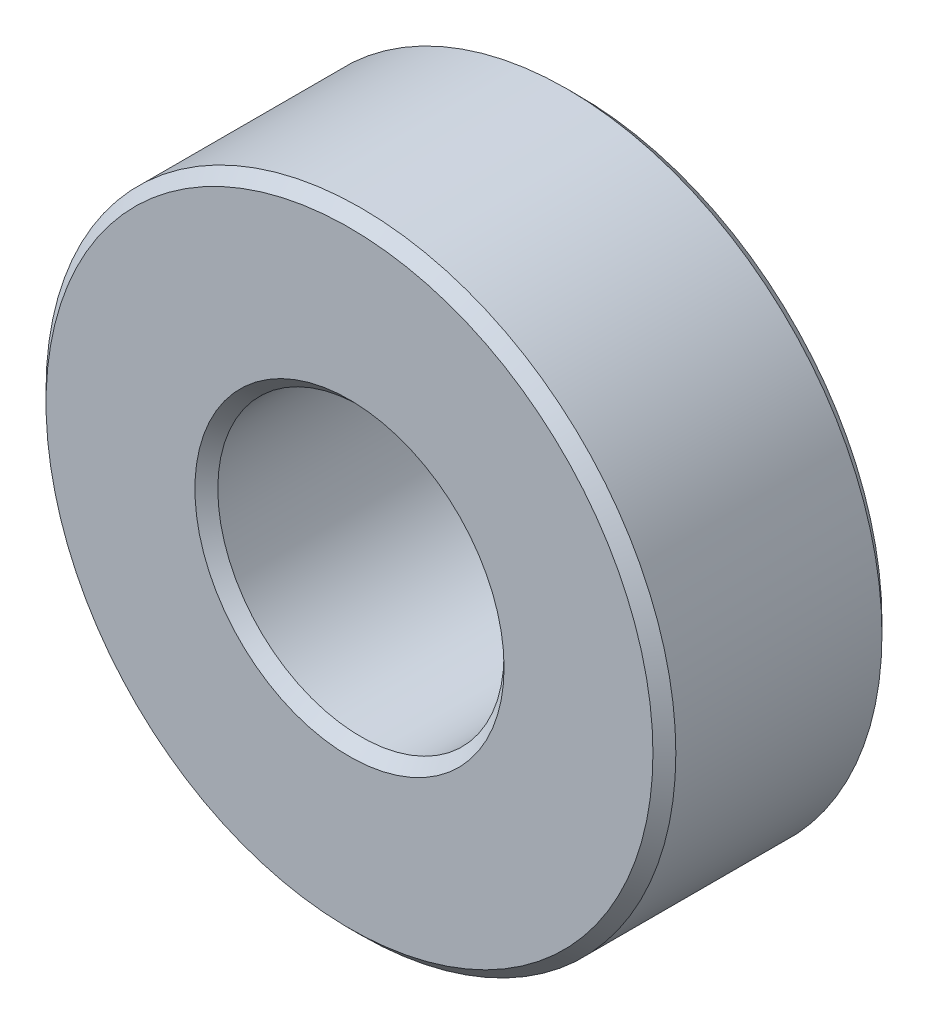
ISO-10303-21;
HEADER;
FILE_DESCRIPTION(('STEP AP214'),'2;1');
FILE_NAME('part.step','',(''),(''),'','','');
FILE_SCHEMA(('AUTOMOTIVE_DESIGN { 1 0 10303 214 1 1 1 1 }'));
ENDSEC;
DATA;
#1=APPLICATION_CONTEXT('core data for automotive mechanical design processes');
#2=APPLICATION_PROTOCOL_DEFINITION('international standard','automotive_design',2000,#1);
#3=PRODUCT_CONTEXT('',#1,'mechanical');
#4=PRODUCT('Part','Part','',(#3));
#5=PRODUCT_RELATED_PRODUCT_CATEGORY('part','',(#4));
#6=PRODUCT_DEFINITION_FORMATION('','',#4);
#7=PRODUCT_DEFINITION_CONTEXT('part definition',#1,'design');
#8=PRODUCT_DEFINITION('design','',#6,#7);
#9=PRODUCT_DEFINITION_SHAPE('','',#8);
#10=(LENGTH_UNIT() NAMED_UNIT(*) SI_UNIT(.MILLI.,.METRE.));
#11=(NAMED_UNIT(*) PLANE_ANGLE_UNIT() SI_UNIT($,.RADIAN.));
#12=(NAMED_UNIT(*) SI_UNIT($,.STERADIAN.) SOLID_ANGLE_UNIT());
#13=UNCERTAINTY_MEASURE_WITH_UNIT(LENGTH_MEASURE(1.E-05),#10,'distance_accuracy_value','');
#14=(GEOMETRIC_REPRESENTATION_CONTEXT(3) GLOBAL_UNCERTAINTY_ASSIGNED_CONTEXT((#13)) GLOBAL_UNIT_ASSIGNED_CONTEXT((#10,
#11,#12)) REPRESENTATION_CONTEXT('',''));
#15=CARTESIAN_POINT('',(0.,0.,0.));
#16=DIRECTION('',(0.,0.,1.));
#17=DIRECTION('',(1.,0.,0.));
#18=AXIS2_PLACEMENT_3D('',#15,#16,#17);
#19=CARTESIAN_POINT('',(0.,0.,4.));
#20=DIRECTION('',(0.,0.,1.));
#21=DIRECTION('',(1.,0.,0.));
#22=AXIS2_PLACEMENT_3D('',#19,#20,#21);
#23=PLANE('',#22);
#24=CARTESIAN_POINT('',(0.,0.,4.));
#25=DIRECTION('',(0.,0.,1.));
#26=DIRECTION('',(1.,0.,0.));
#27=AXIS2_PLACEMENT_3D('',#24,#25,#26);
#28=CIRCLE('',#27,2.7);
#29=CARTESIAN_POINT('',(2.7,0.,4.));
#30=VERTEX_POINT('',#29);
#31=EDGE_CURVE('E10',#30,#30,#28,.F.);
#32=ORIENTED_EDGE('',*,*,#31,.T.);
#33=EDGE_LOOP('',(#32));
#34=FACE_BOUND('',#33,.T.);
#35=CARTESIAN_POINT('',(0.,0.,4.));
#36=DIRECTION('',(0.,0.,1.));
#37=DIRECTION('',(1.,0.,0.));
#38=AXIS2_PLACEMENT_3D('',#35,#36,#37);
#39=CIRCLE('',#38,5.29999999999999);
#40=CARTESIAN_POINT('',(5.29999999999999,0.,4.));
#41=VERTEX_POINT('',#40);
#42=EDGE_CURVE('E43',#41,#41,#39,.T.);
#43=ORIENTED_EDGE('',*,*,#42,.T.);
#44=EDGE_LOOP('',(#43));
#45=FACE_BOUND('',#44,.T.);
#46=ADVANCED_FACE('F35',(#34,#45),#23,.T.);
#47=CARTESIAN_POINT('',(0.,0.,0.));
#48=DIRECTION('',(0.,0.,1.));
#49=DIRECTION('',(1.,0.,0.));
#50=AXIS2_PLACEMENT_3D('',#47,#48,#49);
#51=PLANE('',#50);
#52=CARTESIAN_POINT('',(0.,0.,0.));
#53=DIRECTION('',(0.,0.,1.));
#54=DIRECTION('',(1.,0.,0.));
#55=AXIS2_PLACEMENT_3D('',#52,#53,#54);
#56=CIRCLE('',#55,2.7);
#57=CARTESIAN_POINT('',(2.7,0.,0.));
#58=VERTEX_POINT('',#57);
#59=EDGE_CURVE('E62',#58,#58,#56,.T.);
#60=ORIENTED_EDGE('',*,*,#59,.T.);
#61=EDGE_LOOP('',(#60));
#62=FACE_BOUND('',#61,.T.);
#63=CARTESIAN_POINT('',(0.,0.,0.));
#64=DIRECTION('',(0.,0.,1.));
#65=DIRECTION('',(1.,0.,0.));
#66=AXIS2_PLACEMENT_3D('',#63,#64,#65);
#67=CIRCLE('',#66,5.3);
#68=CARTESIAN_POINT('',(5.3,0.,0.));
#69=VERTEX_POINT('',#68);
#70=EDGE_CURVE('E65',#69,#69,#67,.F.);
#71=ORIENTED_EDGE('',*,*,#70,.T.);
#72=EDGE_LOOP('',(#71));
#73=FACE_BOUND('',#72,.T.);
#74=ADVANCED_FACE('F69',(#62,#73),#51,.F.);
#75=CARTESIAN_POINT('',(0.,0.,4.));
#76=DIRECTION('',(0.,0.,-1.));
#77=DIRECTION('',(-1.,0.,0.));
#78=AXIS2_PLACEMENT_3D('',#75,#76,#77);
#79=CYLINDRICAL_SURFACE('',#78,5.5);
#80=CARTESIAN_POINT('',(0.,0.,0.2));
#81=DIRECTION('',(0.,0.,1.));
#82=DIRECTION('',(1.,0.,0.));
#83=AXIS2_PLACEMENT_3D('',#80,#81,#82);
#84=CIRCLE('',#83,5.5);
#85=CARTESIAN_POINT('',(5.5,0.,0.2));
#86=VERTEX_POINT('',#85);
#87=EDGE_CURVE('E47',#86,#86,#84,.T.);
#88=ORIENTED_EDGE('',*,*,#87,.T.);
#89=EDGE_LOOP('',(#88));
#90=FACE_BOUND('',#89,.T.);
#91=CARTESIAN_POINT('',(0.,0.,3.79999999999999));
#92=DIRECTION('',(0.,0.,1.));
#93=DIRECTION('',(1.,0.,0.));
#94=AXIS2_PLACEMENT_3D('',#91,#92,#93);
#95=CIRCLE('',#94,5.5);
#96=CARTESIAN_POINT('',(5.5,0.,3.79999999999999));
#97=VERTEX_POINT('',#96);
#98=EDGE_CURVE('E51',#97,#97,#95,.F.);
#99=ORIENTED_EDGE('',*,*,#98,.T.);
#100=EDGE_LOOP('',(#99));
#101=FACE_BOUND('',#100,.T.);
#102=ADVANCED_FACE('F79',(#90,#101),#79,.T.);
#103=CARTESIAN_POINT('',(0.,0.,4.));
#104=DIRECTION('',(0.,0.,-1.));
#105=DIRECTION('',(-1.,0.,0.));
#106=AXIS2_PLACEMENT_3D('',#103,#104,#105);
#107=CYLINDRICAL_SURFACE('',#106,2.5);
#108=CARTESIAN_POINT('',(0.,0.,0.200000000000001));
#109=DIRECTION('',(0.,0.,1.));
#110=DIRECTION('',(1.,0.,0.));
#111=AXIS2_PLACEMENT_3D('',#108,#109,#110);
#112=CIRCLE('',#111,2.5);
#113=CARTESIAN_POINT('',(2.5,0.,0.200000000000001));
#114=VERTEX_POINT('',#113);
#115=EDGE_CURVE('E56',#114,#114,#112,.F.);
#116=ORIENTED_EDGE('',*,*,#115,.T.);
#117=EDGE_LOOP('',(#116));
#118=FACE_BOUND('',#117,.T.);
#119=CARTESIAN_POINT('',(0.,0.,3.8));
#120=DIRECTION('',(0.,0.,1.));
#121=DIRECTION('',(1.,0.,0.));
#122=AXIS2_PLACEMENT_3D('',#119,#120,#121);
#123=CIRCLE('',#122,2.5);
#124=CARTESIAN_POINT('',(2.5,0.,3.8));
#125=VERTEX_POINT('',#124);
#126=EDGE_CURVE('E59',#125,#125,#123,.T.);
#127=ORIENTED_EDGE('',*,*,#126,.T.);
#128=EDGE_LOOP('',(#127));
#129=FACE_BOUND('',#128,.T.);
#130=ADVANCED_FACE('F82',(#118,#129),#107,.F.);
#131=CARTESIAN_POINT('',(0.,0.,0.));
#132=DIRECTION('',(0.,0.,-1.));
#133=DIRECTION('',(-1.,0.,0.));
#134=AXIS2_PLACEMENT_3D('',#131,#132,#133);
#135=CONICAL_SURFACE('',#134,2.7,0.785398163397447);
#136=ORIENTED_EDGE('',*,*,#115,.F.);
#137=EDGE_LOOP('',(#136));
#138=FACE_BOUND('',#137,.T.);
#139=ORIENTED_EDGE('',*,*,#59,.F.);
#140=EDGE_LOOP('',(#139));
#141=FACE_BOUND('',#140,.T.);
#142=ADVANCED_FACE('F75',(#138,#141),#135,.F.);
#143=CARTESIAN_POINT('',(0.,0.,0.2));
#144=DIRECTION('',(0.,0.,1.));
#145=DIRECTION('',(1.,0.,0.));
#146=AXIS2_PLACEMENT_3D('',#143,#144,#145);
#147=CONICAL_SURFACE('',#146,5.5,0.785398163397448);
#148=ORIENTED_EDGE('',*,*,#70,.F.);
#149=EDGE_LOOP('',(#148));
#150=FACE_BOUND('',#149,.T.);
#151=ORIENTED_EDGE('',*,*,#87,.F.);
#152=EDGE_LOOP('',(#151));
#153=FACE_BOUND('',#152,.T.);
#154=ADVANCED_FACE('F71',(#150,#153),#147,.T.);
#155=CARTESIAN_POINT('',(0.,0.,3.8));
#156=DIRECTION('',(0.,0.,1.));
#157=DIRECTION('',(1.,0.,0.));
#158=AXIS2_PLACEMENT_3D('',#155,#156,#157);
#159=CONICAL_SURFACE('',#158,2.5,0.785398163397449);
#160=ORIENTED_EDGE('',*,*,#31,.F.);
#161=EDGE_LOOP('',(#160));
#162=FACE_BOUND('',#161,.T.);
#163=ORIENTED_EDGE('',*,*,#126,.F.);
#164=EDGE_LOOP('',(#163));
#165=FACE_BOUND('',#164,.T.);
#166=ADVANCED_FACE('F74',(#162,#165),#159,.F.);
#167=CARTESIAN_POINT('',(0.,0.,4.));
#168=DIRECTION('',(0.,0.,-1.));
#169=DIRECTION('',(-1.,0.,0.));
#170=AXIS2_PLACEMENT_3D('',#167,#168,#169);
#171=CONICAL_SURFACE('',#170,5.29999999999999,0.785398163397448);
#172=ORIENTED_EDGE('',*,*,#98,.F.);
#173=EDGE_LOOP('',(#172));
#174=FACE_BOUND('',#173,.T.);
#175=ORIENTED_EDGE('',*,*,#42,.F.);
#176=EDGE_LOOP('',(#175));
#177=FACE_BOUND('',#176,.T.);
#178=ADVANCED_FACE('F38',(#174,#177),#171,.T.);
#179=CLOSED_SHELL('',(#46,#74,#102,#130,#142,#154,#166,#178));
#180=MANIFOLD_SOLID_BREP('B2',#179);
#181=ADVANCED_BREP_SHAPE_REPRESENTATION('',(#18,#180),#14);
#182=SHAPE_DEFINITION_REPRESENTATION(#9,#181);
ENDSEC;
END-ISO-10303-21;
